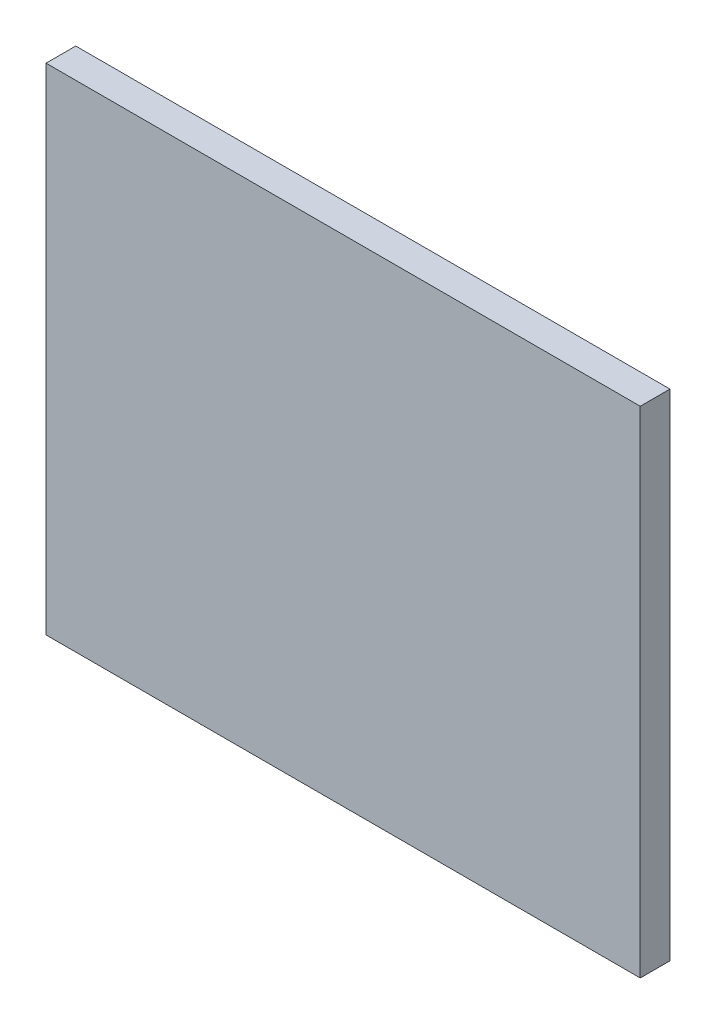
ISO-10303-21;
HEADER;
FILE_DESCRIPTION(('STEP AP214'),'2;1');
FILE_NAME('part.step','',(''),(''),'','','');
FILE_SCHEMA(('AUTOMOTIVE_DESIGN { 1 0 10303 214 1 1 1 1 }'));
ENDSEC;
DATA;
#1=APPLICATION_CONTEXT('core data for automotive mechanical design processes');
#2=APPLICATION_PROTOCOL_DEFINITION('international standard','automotive_design',2000,#1);
#3=PRODUCT_CONTEXT('',#1,'mechanical');
#4=PRODUCT('Part','Part','',(#3));
#5=PRODUCT_RELATED_PRODUCT_CATEGORY('part','',(#4));
#6=PRODUCT_DEFINITION_FORMATION('','',#4);
#7=PRODUCT_DEFINITION_CONTEXT('part definition',#1,'design');
#8=PRODUCT_DEFINITION('design','',#6,#7);
#9=PRODUCT_DEFINITION_SHAPE('','',#8);
#10=(LENGTH_UNIT() NAMED_UNIT(*) SI_UNIT(.MILLI.,.METRE.));
#11=(NAMED_UNIT(*) PLANE_ANGLE_UNIT() SI_UNIT($,.RADIAN.));
#12=(NAMED_UNIT(*) SI_UNIT($,.STERADIAN.) SOLID_ANGLE_UNIT());
#13=UNCERTAINTY_MEASURE_WITH_UNIT(LENGTH_MEASURE(1.E-05),#10,'distance_accuracy_value','');
#14=(GEOMETRIC_REPRESENTATION_CONTEXT(3) GLOBAL_UNCERTAINTY_ASSIGNED_CONTEXT((#13)) GLOBAL_UNIT_ASSIGNED_CONTEXT((#10,
#11,#12)) REPRESENTATION_CONTEXT('',''));
#15=CARTESIAN_POINT('',(0.,0.,0.));
#16=DIRECTION('',(0.,0.,1.));
#17=DIRECTION('',(1.,0.,0.));
#18=AXIS2_PLACEMENT_3D('',#15,#16,#17);
#19=CARTESIAN_POINT('',(1.7749999999709,-0.25,0.));
#20=DIRECTION('',(1.,0.,0.));
#21=DIRECTION('',(0.,1.,0.));
#22=AXIS2_PLACEMENT_3D('',#19,#20,#21);
#23=PLANE('',#22);
#24=DIRECTION('',(0.,-1.,0.));
#25=VECTOR('',#24,1.);
#26=CARTESIAN_POINT('',(1.7749999999709,-0.125,0.0299999999999968));
#27=LINE('',#26,#25);
#28=CARTESIAN_POINT('',(1.7749999999709,0.25,0.0299999999999968));
#29=VERTEX_POINT('',#28);
#30=CARTESIAN_POINT('',(1.7749999999709,-0.25,0.0299999999999968));
#31=VERTEX_POINT('',#30);
#32=EDGE_CURVE('E11',#29,#31,#27,.T.);
#33=ORIENTED_EDGE('',*,*,#32,.T.);
#34=DIRECTION('',(0.,0.,1.));
#35=VECTOR('',#34,1.);
#36=CARTESIAN_POINT('',(1.7749999999709,-0.25,0.));
#37=LINE('',#36,#35);
#38=CARTESIAN_POINT('',(1.7749999999709,-0.25,0.));
#39=VERTEX_POINT('',#38);
#40=EDGE_CURVE('E24',#39,#31,#37,.T.);
#41=ORIENTED_EDGE('',*,*,#40,.F.);
#42=DIRECTION('',(0.,1.,0.));
#43=VECTOR('',#42,1.);
#44=CARTESIAN_POINT('',(1.7749999999709,-0.25,0.));
#45=LINE('',#44,#43);
#46=CARTESIAN_POINT('',(1.7749999999709,0.25,0.));
#47=VERTEX_POINT('',#46);
#48=EDGE_CURVE('E88',#39,#47,#45,.T.);
#49=ORIENTED_EDGE('',*,*,#48,.T.);
#50=DIRECTION('',(0.,0.,1.));
#51=VECTOR('',#50,1.);
#52=CARTESIAN_POINT('',(1.7749999999709,0.25,0.));
#53=LINE('',#52,#51);
#54=EDGE_CURVE('E77',#47,#29,#53,.T.);
#55=ORIENTED_EDGE('',*,*,#54,.T.);
#56=EDGE_LOOP('',(#33,#41,#49,#55));
#57=FACE_BOUND('',#56,.T.);
#58=ADVANCED_FACE('F17',(#57),#23,.T.);
#59=CARTESIAN_POINT('',(1.1749999999709,-0.25,0.));
#60=DIRECTION('',(0.,-1.,0.));
#61=DIRECTION('',(1.,0.,0.));
#62=AXIS2_PLACEMENT_3D('',#59,#60,#61);
#63=PLANE('',#62);
#64=DIRECTION('',(-1.,0.,0.));
#65=VECTOR('',#64,1.);
#66=CARTESIAN_POINT('',(1.3249999999709,-0.25,0.0299999999999968));
#67=LINE('',#66,#65);
#68=CARTESIAN_POINT('',(1.1749999999709,-0.25,0.0299999999999968));
#69=VERTEX_POINT('',#68);
#70=EDGE_CURVE('E85',#31,#69,#67,.T.);
#71=ORIENTED_EDGE('',*,*,#70,.T.);
#72=DIRECTION('',(0.,0.,1.));
#73=VECTOR('',#72,1.);
#74=CARTESIAN_POINT('',(1.1749999999709,-0.25,0.));
#75=LINE('',#74,#73);
#76=CARTESIAN_POINT('',(1.1749999999709,-0.25,0.));
#77=VERTEX_POINT('',#76);
#78=EDGE_CURVE('E83',#77,#69,#75,.T.);
#79=ORIENTED_EDGE('',*,*,#78,.F.);
#80=DIRECTION('',(1.,0.,0.));
#81=VECTOR('',#80,1.);
#82=CARTESIAN_POINT('',(1.0199999999709,-0.25,0.));
#83=LINE('',#82,#81);
#84=EDGE_CURVE('E72',#77,#39,#83,.T.);
#85=ORIENTED_EDGE('',*,*,#84,.T.);
#86=ORIENTED_EDGE('',*,*,#40,.T.);
#87=EDGE_LOOP('',(#71,#79,#85,#86));
#88=FACE_BOUND('',#87,.T.);
#89=ADVANCED_FACE('F90',(#88),#63,.T.);
#90=CARTESIAN_POINT('',(1.1749999999709,0.25,0.));
#91=DIRECTION('',(-1.,0.,0.));
#92=DIRECTION('',(0.,-1.,0.));
#93=AXIS2_PLACEMENT_3D('',#90,#91,#92);
#94=PLANE('',#93);
#95=DIRECTION('',(0.,1.,0.));
#96=VECTOR('',#95,1.);
#97=CARTESIAN_POINT('',(1.1749999999709,0.125,0.0299999999999968));
#98=LINE('',#97,#96);
#99=CARTESIAN_POINT('',(1.1749999999709,0.25,0.0299999999999968));
#100=VERTEX_POINT('',#99);
#101=EDGE_CURVE('E60',#69,#100,#98,.T.);
#102=ORIENTED_EDGE('',*,*,#101,.T.);
#103=DIRECTION('',(0.,0.,1.));
#104=VECTOR('',#103,1.);
#105=CARTESIAN_POINT('',(1.1749999999709,0.25,0.));
#106=LINE('',#105,#104);
#107=CARTESIAN_POINT('',(1.1749999999709,0.25,0.));
#108=VERTEX_POINT('',#107);
#109=EDGE_CURVE('E54',#108,#100,#106,.T.);
#110=ORIENTED_EDGE('',*,*,#109,.F.);
#111=DIRECTION('',(0.,-1.,0.));
#112=VECTOR('',#111,1.);
#113=CARTESIAN_POINT('',(1.1749999999709,0.25,0.));
#114=LINE('',#113,#112);
#115=EDGE_CURVE('E58',#108,#77,#114,.T.);
#116=ORIENTED_EDGE('',*,*,#115,.T.);
#117=ORIENTED_EDGE('',*,*,#78,.T.);
#118=EDGE_LOOP('',(#102,#110,#116,#117));
#119=FACE_BOUND('',#118,.T.);
#120=ADVANCED_FACE('F56',(#119),#94,.T.);
#121=CARTESIAN_POINT('',(1.7749999999709,0.25,0.));
#122=DIRECTION('',(0.,1.,0.));
#123=DIRECTION('',(-1.,0.,0.));
#124=AXIS2_PLACEMENT_3D('',#121,#122,#123);
#125=PLANE('',#124);
#126=DIRECTION('',(1.,0.,0.));
#127=VECTOR('',#126,1.);
#128=CARTESIAN_POINT('',(1.6249999999709,0.25,0.0299999999999968));
#129=LINE('',#128,#127);
#130=EDGE_CURVE('E73',#100,#29,#129,.T.);
#131=ORIENTED_EDGE('',*,*,#130,.T.);
#132=ORIENTED_EDGE('',*,*,#54,.F.);
#133=DIRECTION('',(-1.,0.,0.));
#134=VECTOR('',#133,1.);
#135=CARTESIAN_POINT('',(1.9299999999709,0.25,0.));
#136=LINE('',#135,#134);
#137=EDGE_CURVE('E70',#47,#108,#136,.T.);
#138=ORIENTED_EDGE('',*,*,#137,.T.);
#139=ORIENTED_EDGE('',*,*,#109,.T.);
#140=EDGE_LOOP('',(#131,#132,#138,#139));
#141=FACE_BOUND('',#140,.T.);
#142=ADVANCED_FACE('F76',(#141),#125,.T.);
#143=CARTESIAN_POINT('',(1.4749999999709,0.,0.));
#144=DIRECTION('',(0.,0.,1.));
#145=DIRECTION('',(1.,0.,0.));
#146=AXIS2_PLACEMENT_3D('',#143,#144,#145);
#147=PLANE('',#146);
#148=ORIENTED_EDGE('',*,*,#84,.F.);
#149=ORIENTED_EDGE('',*,*,#115,.F.);
#150=ORIENTED_EDGE('',*,*,#137,.F.);
#151=ORIENTED_EDGE('',*,*,#48,.F.);
#152=EDGE_LOOP('',(#148,#149,#150,#151));
#153=FACE_BOUND('',#152,.T.);
#154=ADVANCED_FACE('F68',(#153),#147,.F.);
#155=CARTESIAN_POINT('',(1.4749999999709,0.,0.0299999999999968));
#156=DIRECTION('',(0.,0.,1.));
#157=DIRECTION('',(1.,0.,0.));
#158=AXIS2_PLACEMENT_3D('',#155,#156,#157);
#159=PLANE('',#158);
#160=ORIENTED_EDGE('',*,*,#101,.F.);
#161=ORIENTED_EDGE('',*,*,#70,.F.);
#162=ORIENTED_EDGE('',*,*,#32,.F.);
#163=ORIENTED_EDGE('',*,*,#130,.F.);
#164=EDGE_LOOP('',(#160,#161,#162,#163));
#165=FACE_BOUND('',#164,.T.);
#166=ADVANCED_FACE('F91',(#165),#159,.T.);
#167=CLOSED_SHELL('',(#58,#89,#120,#142,#154,#166));
#168=MANIFOLD_SOLID_BREP('B1',#167);
#169=ADVANCED_BREP_SHAPE_REPRESENTATION('',(#18,#168),#14);
#170=SHAPE_DEFINITION_REPRESENTATION(#9,#169);
ENDSEC;
END-ISO-10303-21;
